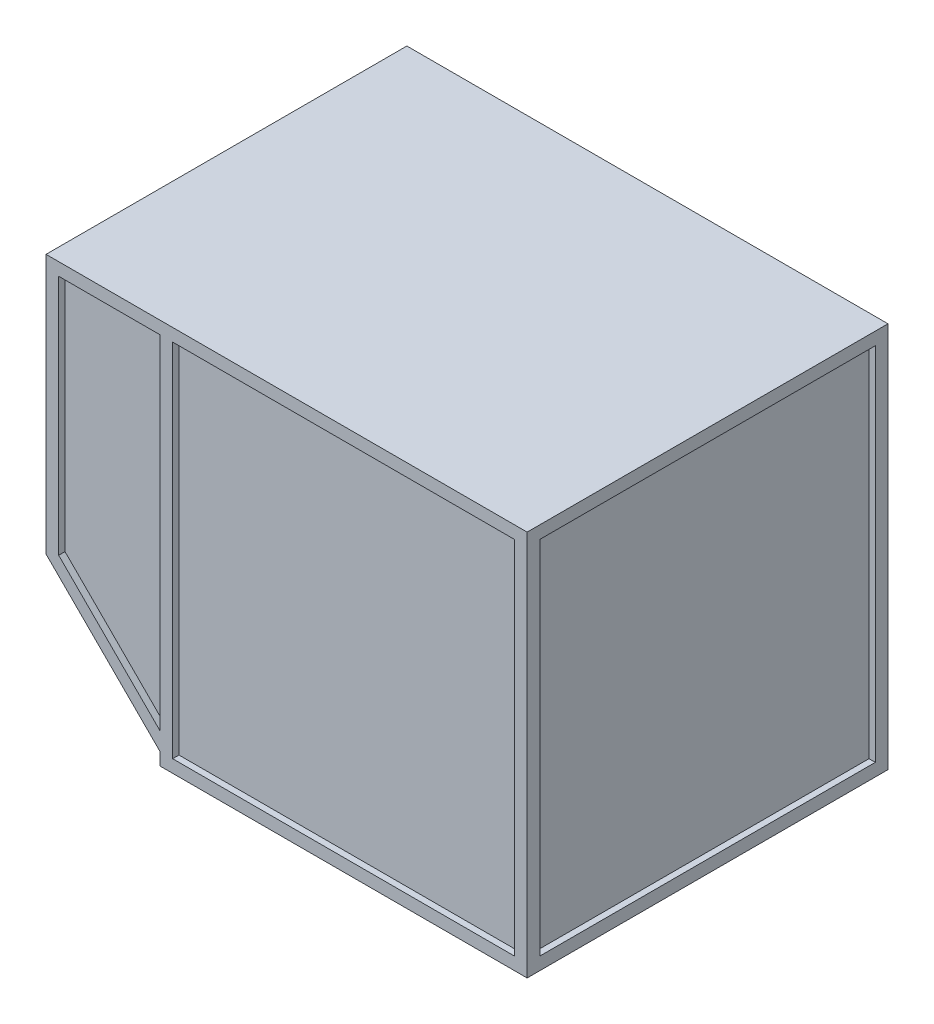
ISO-10303-21;
HEADER;
FILE_DESCRIPTION(('STEP AP214'),'2;1');
FILE_NAME('part.step','',(''),(''),'','','');
FILE_SCHEMA(('AUTOMOTIVE_DESIGN { 1 0 10303 214 1 1 1 1 }'));
ENDSEC;
DATA;
#1=APPLICATION_CONTEXT('core data for automotive mechanical design processes');
#2=APPLICATION_PROTOCOL_DEFINITION('international standard','automotive_design',2000,#1);
#3=PRODUCT_CONTEXT('',#1,'mechanical');
#4=PRODUCT('Part','Part','',(#3));
#5=PRODUCT_RELATED_PRODUCT_CATEGORY('part','',(#4));
#6=PRODUCT_DEFINITION_FORMATION('','',#4);
#7=PRODUCT_DEFINITION_CONTEXT('part definition',#1,'design');
#8=PRODUCT_DEFINITION('design','',#6,#7);
#9=PRODUCT_DEFINITION_SHAPE('','',#8);
#10=(LENGTH_UNIT() NAMED_UNIT(*) SI_UNIT(.MILLI.,.METRE.));
#11=(NAMED_UNIT(*) PLANE_ANGLE_UNIT() SI_UNIT($,.RADIAN.));
#12=(NAMED_UNIT(*) SI_UNIT($,.STERADIAN.) SOLID_ANGLE_UNIT());
#13=UNCERTAINTY_MEASURE_WITH_UNIT(LENGTH_MEASURE(1.E-05),#10,'distance_accuracy_value','');
#14=(GEOMETRIC_REPRESENTATION_CONTEXT(3) GLOBAL_UNCERTAINTY_ASSIGNED_CONTEXT((#13)) GLOBAL_UNIT_ASSIGNED_CONTEXT((#10,
#11,#12)) REPRESENTATION_CONTEXT('',''));
#15=CARTESIAN_POINT('',(0.,0.,0.));
#16=DIRECTION('',(0.,0.,1.));
#17=DIRECTION('',(1.,0.,0.));
#18=AXIS2_PLACEMENT_3D('',#15,#16,#17);
#19=CARTESIAN_POINT('',(-965.2,1549.4,-723.9));
#20=DIRECTION('',(0.,0.,1.));
#21=DIRECTION('',(1.,0.,0.));
#22=AXIS2_PLACEMENT_3D('',#19,#20,#21);
#23=PLANE('',#22);
#24=DIRECTION('',(0.,-1.,0.));
#25=VECTOR('',#24,1.);
#26=CARTESIAN_POINT('',(-914.4,1549.4,-723.9));
#27=LINE('',#26,#25);
#28=CARTESIAN_POINT('',(-914.4,1498.6,-723.9));
#29=VERTEX_POINT('',#28);
#30=CARTESIAN_POINT('',(-914.4,529.042048968553,-723.9));
#31=VERTEX_POINT('',#30);
#32=EDGE_CURVE('E328',#29,#31,#27,.T.);
#33=ORIENTED_EDGE('',*,*,#32,.T.);
#34=DIRECTION('',(0.707106781186548,-0.707106781186547,0.));
#35=VECTOR('',#34,1.);
#36=CARTESIAN_POINT('',(-1449.97897551572,1064.62102448428,-723.9));
#37=LINE('',#36,#35);
#38=CARTESIAN_POINT('',(-508.,122.642048968554,-723.9));
#39=VERTEX_POINT('',#38);
#40=EDGE_CURVE('E342',#31,#39,#37,.T.);
#41=ORIENTED_EDGE('',*,*,#40,.T.);
#42=DIRECTION('',(0.,1.,0.));
#43=VECTOR('',#42,1.);
#44=CARTESIAN_POINT('',(-508.,1549.4,-723.9));
#45=LINE('',#44,#43);
#46=CARTESIAN_POINT('',(-508.,1498.6,-723.9));
#47=VERTEX_POINT('',#46);
#48=EDGE_CURVE('E345',#39,#47,#45,.T.);
#49=ORIENTED_EDGE('',*,*,#48,.T.);
#50=DIRECTION('',(-1.,0.,0.));
#51=VECTOR('',#50,1.);
#52=CARTESIAN_POINT('',(-965.2,1498.6,-723.9));
#53=LINE('',#52,#51);
#54=EDGE_CURVE('E333',#47,#29,#53,.T.);
#55=ORIENTED_EDGE('',*,*,#54,.T.);
#56=EDGE_LOOP('',(#33,#41,#49,#55));
#57=FACE_BOUND('',#56,.T.);
#58=DIRECTION('',(0.,-1.,0.));
#59=VECTOR('',#58,1.);
#60=CARTESIAN_POINT('',(-508.,0.,-723.9));
#61=LINE('',#60,#59);
#62=CARTESIAN_POINT('',(-508.,50.8,-723.9));
#63=VERTEX_POINT('',#62);
#64=CARTESIAN_POINT('',(-508.,0.,-723.9));
#65=VERTEX_POINT('',#64);
#66=EDGE_CURVE('E423',#63,#65,#61,.T.);
#67=ORIENTED_EDGE('',*,*,#66,.F.);
#68=DIRECTION('',(0.707106781186547,-0.707106781186548,0.));
#69=VECTOR('',#68,1.);
#70=CARTESIAN_POINT('',(-508.,50.8,-723.9));
#71=LINE('',#70,#69);
#72=CARTESIAN_POINT('',(-965.2,508.,-723.9));
#73=VERTEX_POINT('',#72);
#74=EDGE_CURVE('E425',#73,#63,#71,.T.);
#75=ORIENTED_EDGE('',*,*,#74,.F.);
#76=DIRECTION('',(0.,-1.,0.));
#77=VECTOR('',#76,1.);
#78=CARTESIAN_POINT('',(-965.2,1549.4,-723.9));
#79=LINE('',#78,#77);
#80=CARTESIAN_POINT('',(-965.2,1549.4,-723.9));
#81=VERTEX_POINT('',#80);
#82=EDGE_CURVE('E449',#81,#73,#79,.T.);
#83=ORIENTED_EDGE('',*,*,#82,.F.);
#84=DIRECTION('',(-1.,0.,0.));
#85=VECTOR('',#84,1.);
#86=CARTESIAN_POINT('',(-965.2,1549.4,-723.9));
#87=LINE('',#86,#85);
#88=CARTESIAN_POINT('',(965.2,1549.4,-723.9));
#89=VERTEX_POINT('',#88);
#90=EDGE_CURVE('E447',#89,#81,#87,.T.);
#91=ORIENTED_EDGE('',*,*,#90,.F.);
#92=DIRECTION('',(0.,-1.,0.));
#93=VECTOR('',#92,1.);
#94=CARTESIAN_POINT('',(965.2,1549.4,-723.9));
#95=LINE('',#94,#93);
#96=CARTESIAN_POINT('',(965.2,0.,-723.9));
#97=VERTEX_POINT('',#96);
#98=EDGE_CURVE('E457',#89,#97,#95,.T.);
#99=ORIENTED_EDGE('',*,*,#98,.T.);
#100=DIRECTION('',(-1.,0.,0.));
#101=VECTOR('',#100,1.);
#102=CARTESIAN_POINT('',(-965.2,0.,-723.9));
#103=LINE('',#102,#101);
#104=EDGE_CURVE('E443',#97,#65,#103,.T.);
#105=ORIENTED_EDGE('',*,*,#104,.T.);
#106=EDGE_LOOP('',(#67,#75,#83,#91,#99,#105));
#107=FACE_BOUND('',#106,.T.);
#108=DIRECTION('',(1.,0.,0.));
#109=VECTOR('',#108,1.);
#110=CARTESIAN_POINT('',(-965.2,50.8,-723.9));
#111=LINE('',#110,#109);
#112=CARTESIAN_POINT('',(-457.2,50.8,-723.9));
#113=VERTEX_POINT('',#112);
#114=CARTESIAN_POINT('',(914.4,50.8,-723.9));
#115=VERTEX_POINT('',#114);
#116=EDGE_CURVE('E291',#113,#115,#111,.T.);
#117=ORIENTED_EDGE('',*,*,#116,.T.);
#118=DIRECTION('',(0.,1.,0.));
#119=VECTOR('',#118,1.);
#120=CARTESIAN_POINT('',(914.4,1549.4,-723.9));
#121=LINE('',#120,#119);
#122=CARTESIAN_POINT('',(914.4,1498.6,-723.9));
#123=VERTEX_POINT('',#122);
#124=EDGE_CURVE('E310',#115,#123,#121,.T.);
#125=ORIENTED_EDGE('',*,*,#124,.T.);
#126=DIRECTION('',(-1.,0.,0.));
#127=VECTOR('',#126,1.);
#128=CARTESIAN_POINT('',(-965.2,1498.6,-723.9));
#129=LINE('',#128,#127);
#130=CARTESIAN_POINT('',(-457.2,1498.6,-723.9));
#131=VERTEX_POINT('',#130);
#132=EDGE_CURVE('E313',#123,#131,#129,.T.);
#133=ORIENTED_EDGE('',*,*,#132,.T.);
#134=DIRECTION('',(0.,-1.,0.));
#135=VECTOR('',#134,1.);
#136=CARTESIAN_POINT('',(-457.2,1549.4,-723.9));
#137=LINE('',#136,#135);
#138=EDGE_CURVE('E301',#131,#113,#137,.T.);
#139=ORIENTED_EDGE('',*,*,#138,.T.);
#140=EDGE_LOOP('',(#117,#125,#133,#139));
#141=FACE_BOUND('',#140,.T.);
#142=ADVANCED_FACE('F31',(#57,#107,#141),#23,.F.);
#143=CARTESIAN_POINT('',(-965.2,1549.4,-723.9));
#144=DIRECTION('',(1.,0.,0.));
#145=DIRECTION('',(0.,0.,-1.));
#146=AXIS2_PLACEMENT_3D('',#143,#144,#145);
#147=PLANE('',#146);
#148=DIRECTION('',(0.,0.,1.));
#149=VECTOR('',#148,1.);
#150=CARTESIAN_POINT('',(-965.2,558.8,-673.1));
#151=LINE('',#150,#149);
#152=CARTESIAN_POINT('',(-965.2,558.8,-673.1));
#153=VERTEX_POINT('',#152);
#154=CARTESIAN_POINT('',(-965.2,558.8,673.1));
#155=VERTEX_POINT('',#154);
#156=EDGE_CURVE('E281',#153,#155,#151,.T.);
#157=ORIENTED_EDGE('',*,*,#156,.F.);
#158=DIRECTION('',(0.,-1.,0.));
#159=VECTOR('',#158,1.);
#160=CARTESIAN_POINT('',(-965.2,1498.6,-673.1));
#161=LINE('',#160,#159);
#162=CARTESIAN_POINT('',(-965.2,1498.6,-673.1));
#163=VERTEX_POINT('',#162);
#164=EDGE_CURVE('E54',#163,#153,#161,.T.);
#165=ORIENTED_EDGE('',*,*,#164,.F.);
#166=DIRECTION('',(0.,0.,-1.));
#167=VECTOR('',#166,1.);
#168=CARTESIAN_POINT('',(-965.2,1498.6,-673.1));
#169=LINE('',#168,#167);
#170=CARTESIAN_POINT('',(-965.2,1498.6,673.1));
#171=VERTEX_POINT('',#170);
#172=EDGE_CURVE('E270',#171,#163,#169,.T.);
#173=ORIENTED_EDGE('',*,*,#172,.F.);
#174=DIRECTION('',(0.,1.,0.));
#175=VECTOR('',#174,1.);
#176=CARTESIAN_POINT('',(-965.2,1498.6,673.1));
#177=LINE('',#176,#175);
#178=EDGE_CURVE('E284',#155,#171,#177,.T.);
#179=ORIENTED_EDGE('',*,*,#178,.F.);
#180=EDGE_LOOP('',(#157,#165,#173,#179));
#181=FACE_BOUND('',#180,.T.);
#182=ORIENTED_EDGE('',*,*,#82,.T.);
#183=DIRECTION('',(0.,0.,1.));
#184=VECTOR('',#183,1.);
#185=CARTESIAN_POINT('',(-965.2,508.,-1407.34410159134));
#186=LINE('',#185,#184);
#187=CARTESIAN_POINT('',(-965.2,508.,723.9));
#188=VERTEX_POINT('',#187);
#189=EDGE_CURVE('E426',#73,#188,#186,.T.);
#190=ORIENTED_EDGE('',*,*,#189,.T.);
#191=DIRECTION('',(0.,-1.,0.));
#192=VECTOR('',#191,1.);
#193=CARTESIAN_POINT('',(-965.2,1549.4,723.9));
#194=LINE('',#193,#192);
#195=CARTESIAN_POINT('',(-965.2,1549.4,723.9));
#196=VERTEX_POINT('',#195);
#197=EDGE_CURVE('E11',#196,#188,#194,.T.);
#198=ORIENTED_EDGE('',*,*,#197,.F.);
#199=DIRECTION('',(0.,0.,1.));
#200=VECTOR('',#199,1.);
#201=CARTESIAN_POINT('',(-965.2,1549.4,-723.9));
#202=LINE('',#201,#200);
#203=EDGE_CURVE('E439',#81,#196,#202,.T.);
#204=ORIENTED_EDGE('',*,*,#203,.F.);
#205=EDGE_LOOP('',(#182,#190,#198,#204));
#206=FACE_BOUND('',#205,.T.);
#207=ADVANCED_FACE('F33',(#181,#206),#147,.F.);
#208=CARTESIAN_POINT('',(-965.2,1549.4,723.9));
#209=DIRECTION('',(0.,0.,-1.));
#210=DIRECTION('',(-1.,0.,0.));
#211=AXIS2_PLACEMENT_3D('',#208,#209,#210);
#212=PLANE('',#211);
#213=DIRECTION('',(0.,-1.,0.));
#214=VECTOR('',#213,1.);
#215=CARTESIAN_POINT('',(-457.2,71.8420489685534,723.9));
#216=LINE('',#215,#214);
#217=CARTESIAN_POINT('',(-457.2,1498.6,723.9));
#218=VERTEX_POINT('',#217);
#219=CARTESIAN_POINT('',(-457.2,50.8,723.9));
#220=VERTEX_POINT('',#219);
#221=EDGE_CURVE('E359',#218,#220,#216,.T.);
#222=ORIENTED_EDGE('',*,*,#221,.F.);
#223=DIRECTION('',(-1.,0.,0.));
#224=VECTOR('',#223,1.);
#225=CARTESIAN_POINT('',(914.4,1498.6,723.9));
#226=LINE('',#225,#224);
#227=CARTESIAN_POINT('',(914.4,1498.6,723.9));
#228=VERTEX_POINT('',#227);
#229=EDGE_CURVE('E363',#228,#218,#226,.T.);
#230=ORIENTED_EDGE('',*,*,#229,.F.);
#231=DIRECTION('',(0.,1.,0.));
#232=VECTOR('',#231,1.);
#233=CARTESIAN_POINT('',(914.4,50.8,723.9));
#234=LINE('',#233,#232);
#235=CARTESIAN_POINT('',(914.4,50.8,723.9));
#236=VERTEX_POINT('',#235);
#237=EDGE_CURVE('E378',#236,#228,#234,.T.);
#238=ORIENTED_EDGE('',*,*,#237,.F.);
#239=DIRECTION('',(1.,0.,0.));
#240=VECTOR('',#239,1.);
#241=CARTESIAN_POINT('',(-457.2,50.8,723.9));
#242=LINE('',#241,#240);
#243=EDGE_CURVE('E375',#220,#236,#242,.T.);
#244=ORIENTED_EDGE('',*,*,#243,.F.);
#245=EDGE_LOOP('',(#222,#230,#238,#244));
#246=FACE_BOUND('',#245,.T.);
#247=DIRECTION('',(0.,-1.,0.));
#248=VECTOR('',#247,1.);
#249=CARTESIAN_POINT('',(-914.4,1498.6,723.9));
#250=LINE('',#249,#248);
#251=CARTESIAN_POINT('',(-914.4,1498.6,723.9));
#252=VERTEX_POINT('',#251);
#253=CARTESIAN_POINT('',(-914.4,529.042048968553,723.9));
#254=VERTEX_POINT('',#253);
#255=EDGE_CURVE('E406',#252,#254,#250,.T.);
#256=ORIENTED_EDGE('',*,*,#255,.F.);
#257=DIRECTION('',(-1.,0.,0.));
#258=VECTOR('',#257,1.);
#259=CARTESIAN_POINT('',(-508.,1498.6,723.9));
#260=LINE('',#259,#258);
#261=CARTESIAN_POINT('',(-508.,1498.6,723.9));
#262=VERTEX_POINT('',#261);
#263=EDGE_CURVE('E385',#262,#252,#260,.T.);
#264=ORIENTED_EDGE('',*,*,#263,.F.);
#265=DIRECTION('',(0.,1.,0.));
#266=VECTOR('',#265,1.);
#267=CARTESIAN_POINT('',(-508.,1498.6,723.9));
#268=LINE('',#267,#266);
#269=CARTESIAN_POINT('',(-508.,122.642048968554,723.9));
#270=VERTEX_POINT('',#269);
#271=EDGE_CURVE('E395',#270,#262,#268,.T.);
#272=ORIENTED_EDGE('',*,*,#271,.F.);
#273=DIRECTION('',(0.707106781186548,-0.707106781186547,0.));
#274=VECTOR('',#273,1.);
#275=CARTESIAN_POINT('',(-914.4,529.042048968553,723.9));
#276=LINE('',#275,#274);
#277=EDGE_CURVE('E409',#254,#270,#276,.T.);
#278=ORIENTED_EDGE('',*,*,#277,.F.);
#279=EDGE_LOOP('',(#256,#264,#272,#278));
#280=FACE_BOUND('',#279,.T.);
#281=ORIENTED_EDGE('',*,*,#197,.T.);
#282=DIRECTION('',(-0.707106781186547,0.707106781186548,0.));
#283=VECTOR('',#282,1.);
#284=CARTESIAN_POINT('',(-508.,50.8,723.9));
#285=LINE('',#284,#283);
#286=CARTESIAN_POINT('',(-508.,50.8,723.9));
#287=VERTEX_POINT('',#286);
#288=EDGE_CURVE('E431',#287,#188,#285,.T.);
#289=ORIENTED_EDGE('',*,*,#288,.F.);
#290=DIRECTION('',(0.,1.,0.));
#291=VECTOR('',#290,1.);
#292=CARTESIAN_POINT('',(-508.,0.,723.9));
#293=LINE('',#292,#291);
#294=CARTESIAN_POINT('',(-508.,0.,723.9));
#295=VERTEX_POINT('',#294);
#296=EDGE_CURVE('E416',#295,#287,#293,.T.);
#297=ORIENTED_EDGE('',*,*,#296,.F.);
#298=DIRECTION('',(1.,0.,0.));
#299=VECTOR('',#298,1.);
#300=CARTESIAN_POINT('',(-965.2,0.,723.9));
#301=LINE('',#300,#299);
#302=CARTESIAN_POINT('',(965.2,0.,723.9));
#303=VERTEX_POINT('',#302);
#304=EDGE_CURVE('E428',#295,#303,#301,.T.);
#305=ORIENTED_EDGE('',*,*,#304,.T.);
#306=DIRECTION('',(0.,-1.,0.));
#307=VECTOR('',#306,1.);
#308=CARTESIAN_POINT('',(965.2,1549.4,723.9));
#309=LINE('',#308,#307);
#310=CARTESIAN_POINT('',(965.2,1549.4,723.9));
#311=VERTEX_POINT('',#310);
#312=EDGE_CURVE('E39',#311,#303,#309,.T.);
#313=ORIENTED_EDGE('',*,*,#312,.F.);
#314=DIRECTION('',(1.,0.,0.));
#315=VECTOR('',#314,1.);
#316=CARTESIAN_POINT('',(-965.2,1549.4,723.9));
#317=LINE('',#316,#315);
#318=EDGE_CURVE('E442',#196,#311,#317,.T.);
#319=ORIENTED_EDGE('',*,*,#318,.F.);
#320=EDGE_LOOP('',(#281,#289,#297,#305,#313,#319));
#321=FACE_BOUND('',#320,.T.);
#322=ADVANCED_FACE('F482',(#246,#280,#321),#212,.F.);
#323=CARTESIAN_POINT('',(965.2,1549.4,-723.9));
#324=DIRECTION('',(-1.,0.,0.));
#325=DIRECTION('',(0.,0.,1.));
#326=AXIS2_PLACEMENT_3D('',#323,#324,#325);
#327=PLANE('',#326);
#328=DIRECTION('',(0.,0.,-1.));
#329=VECTOR('',#328,1.);
#330=CARTESIAN_POINT('',(965.2,50.8,673.1));
#331=LINE('',#330,#329);
#332=CARTESIAN_POINT('',(965.2,50.8,673.1));
#333=VERTEX_POINT('',#332);
#334=CARTESIAN_POINT('',(965.2,50.8,-673.1));
#335=VERTEX_POINT('',#334);
#336=EDGE_CURVE('E257',#333,#335,#331,.T.);
#337=ORIENTED_EDGE('',*,*,#336,.F.);
#338=DIRECTION('',(0.,-1.,0.));
#339=VECTOR('',#338,1.);
#340=CARTESIAN_POINT('',(965.2,1498.6,673.1));
#341=LINE('',#340,#339);
#342=CARTESIAN_POINT('',(965.2,1498.6,673.1));
#343=VERTEX_POINT('',#342);
#344=EDGE_CURVE('E46',#343,#333,#341,.T.);
#345=ORIENTED_EDGE('',*,*,#344,.F.);
#346=DIRECTION('',(0.,0.,1.));
#347=VECTOR('',#346,1.);
#348=CARTESIAN_POINT('',(965.2,1498.6,-673.1));
#349=LINE('',#348,#347);
#350=CARTESIAN_POINT('',(965.2,1498.6,-673.1));
#351=VERTEX_POINT('',#350);
#352=EDGE_CURVE('E248',#351,#343,#349,.T.);
#353=ORIENTED_EDGE('',*,*,#352,.F.);
#354=DIRECTION('',(0.,1.,0.));
#355=VECTOR('',#354,1.);
#356=CARTESIAN_POINT('',(965.2,50.8,-673.1));
#357=LINE('',#356,#355);
#358=EDGE_CURVE('E251',#335,#351,#357,.T.);
#359=ORIENTED_EDGE('',*,*,#358,.F.);
#360=EDGE_LOOP('',(#337,#345,#353,#359));
#361=FACE_BOUND('',#360,.T.);
#362=DIRECTION('',(0.,0.,-1.));
#363=VECTOR('',#362,1.);
#364=CARTESIAN_POINT('',(965.2,0.,-723.9));
#365=LINE('',#364,#363);
#366=EDGE_CURVE('E451',#303,#97,#365,.T.);
#367=ORIENTED_EDGE('',*,*,#366,.T.);
#368=ORIENTED_EDGE('',*,*,#98,.F.);
#369=DIRECTION('',(0.,0.,-1.));
#370=VECTOR('',#369,1.);
#371=CARTESIAN_POINT('',(965.2,1549.4,-723.9));
#372=LINE('',#371,#370);
#373=EDGE_CURVE('E445',#311,#89,#372,.T.);
#374=ORIENTED_EDGE('',*,*,#373,.F.);
#375=ORIENTED_EDGE('',*,*,#312,.T.);
#376=EDGE_LOOP('',(#367,#368,#374,#375));
#377=FACE_BOUND('',#376,.T.);
#378=ADVANCED_FACE('F464',(#361,#377),#327,.F.);
#379=CARTESIAN_POINT('',(-965.2,1549.4,723.9));
#380=DIRECTION('',(0.,1.,0.));
#381=DIRECTION('',(0.,0.,1.));
#382=AXIS2_PLACEMENT_3D('',#379,#380,#381);
#383=PLANE('',#382);
#384=ORIENTED_EDGE('',*,*,#203,.T.);
#385=ORIENTED_EDGE('',*,*,#318,.T.);
#386=ORIENTED_EDGE('',*,*,#373,.T.);
#387=ORIENTED_EDGE('',*,*,#90,.T.);
#388=EDGE_LOOP('',(#384,#385,#386,#387));
#389=FACE_BOUND('',#388,.T.);
#390=ADVANCED_FACE('F480',(#389),#383,.T.);
#391=CARTESIAN_POINT('',(-965.2,0.,723.9));
#392=DIRECTION('',(0.,1.,0.));
#393=DIRECTION('',(0.,0.,1.));
#394=AXIS2_PLACEMENT_3D('',#391,#392,#393);
#395=PLANE('',#394);
#396=ORIENTED_EDGE('',*,*,#304,.F.);
#397=DIRECTION('',(0.,0.,1.));
#398=VECTOR('',#397,1.);
#399=CARTESIAN_POINT('',(-508.,0.,-1407.34410159134));
#400=LINE('',#399,#398);
#401=EDGE_CURVE('E433',#65,#295,#400,.T.);
#402=ORIENTED_EDGE('',*,*,#401,.F.);
#403=ORIENTED_EDGE('',*,*,#104,.F.);
#404=ORIENTED_EDGE('',*,*,#366,.F.);
#405=EDGE_LOOP('',(#396,#402,#403,#404));
#406=FACE_BOUND('',#405,.T.);
#407=ADVANCED_FACE('F470',(#406),#395,.F.);
#408=CARTESIAN_POINT('',(-508.,50.8,-1407.34410159134));
#409=DIRECTION('',(0.707106781186548,0.707106781186547,0.));
#410=DIRECTION('',(-0.707106781186547,0.707106781186548,0.));
#411=AXIS2_PLACEMENT_3D('',#408,#409,#410);
#412=PLANE('',#411);
#413=ORIENTED_EDGE('',*,*,#74,.T.);
#414=DIRECTION('',(0.,0.,1.));
#415=VECTOR('',#414,1.);
#416=CARTESIAN_POINT('',(-508.,50.8,-1407.34410159134));
#417=LINE('',#416,#415);
#418=EDGE_CURVE('E436',#63,#287,#417,.T.);
#419=ORIENTED_EDGE('',*,*,#418,.T.);
#420=ORIENTED_EDGE('',*,*,#288,.T.);
#421=ORIENTED_EDGE('',*,*,#189,.F.);
#422=EDGE_LOOP('',(#413,#419,#420,#421));
#423=FACE_BOUND('',#422,.T.);
#424=ADVANCED_FACE('F487',(#423),#412,.F.);
#425=CARTESIAN_POINT('',(-508.,0.,-1407.34410159134));
#426=DIRECTION('',(1.,0.,0.));
#427=DIRECTION('',(0.,0.,-1.));
#428=AXIS2_PLACEMENT_3D('',#425,#426,#427);
#429=PLANE('',#428);
#430=ORIENTED_EDGE('',*,*,#66,.T.);
#431=ORIENTED_EDGE('',*,*,#401,.T.);
#432=ORIENTED_EDGE('',*,*,#296,.T.);
#433=ORIENTED_EDGE('',*,*,#418,.F.);
#434=EDGE_LOOP('',(#430,#431,#432,#433));
#435=FACE_BOUND('',#434,.T.);
#436=ADVANCED_FACE('F490',(#435),#429,.F.);
#437=CARTESIAN_POINT('',(-508.,1498.6,698.5));
#438=DIRECTION('',(0.,1.,0.));
#439=DIRECTION('',(0.,0.,1.));
#440=AXIS2_PLACEMENT_3D('',#437,#438,#439);
#441=PLANE('',#440);
#442=ORIENTED_EDGE('',*,*,#263,.T.);
#443=DIRECTION('',(0.,0.,1.));
#444=VECTOR('',#443,1.);
#445=CARTESIAN_POINT('',(-914.4,1498.6,698.5));
#446=LINE('',#445,#444);
#447=CARTESIAN_POINT('',(-914.4,1498.6,698.5));
#448=VERTEX_POINT('',#447);
#449=EDGE_CURVE('E404',#448,#252,#446,.T.);
#450=ORIENTED_EDGE('',*,*,#449,.F.);
#451=DIRECTION('',(-1.,0.,0.));
#452=VECTOR('',#451,1.);
#453=CARTESIAN_POINT('',(-508.,1498.6,698.5));
#454=LINE('',#453,#452);
#455=CARTESIAN_POINT('',(-508.,1498.6,698.5));
#456=VERTEX_POINT('',#455);
#457=EDGE_CURVE('E391',#456,#448,#454,.T.);
#458=ORIENTED_EDGE('',*,*,#457,.F.);
#459=DIRECTION('',(0.,0.,1.));
#460=VECTOR('',#459,1.);
#461=CARTESIAN_POINT('',(-508.,1498.6,698.5));
#462=LINE('',#461,#460);
#463=EDGE_CURVE('E414',#456,#262,#462,.T.);
#464=ORIENTED_EDGE('',*,*,#463,.T.);
#465=EDGE_LOOP('',(#442,#450,#458,#464));
#466=FACE_BOUND('',#465,.T.);
#467=ADVANCED_FACE('F492',(#466),#441,.F.);
#468=CARTESIAN_POINT('',(-508.,1498.6,698.5));
#469=DIRECTION('',(1.,0.,0.));
#470=DIRECTION('',(0.,0.,-1.));
#471=AXIS2_PLACEMENT_3D('',#468,#469,#470);
#472=PLANE('',#471);
#473=ORIENTED_EDGE('',*,*,#271,.T.);
#474=ORIENTED_EDGE('',*,*,#463,.F.);
#475=DIRECTION('',(0.,1.,0.));
#476=VECTOR('',#475,1.);
#477=CARTESIAN_POINT('',(-508.,1498.6,698.5));
#478=LINE('',#477,#476);
#479=CARTESIAN_POINT('',(-508.,122.642048968554,698.5));
#480=VERTEX_POINT('',#479);
#481=EDGE_CURVE('E401',#480,#456,#478,.T.);
#482=ORIENTED_EDGE('',*,*,#481,.F.);
#483=DIRECTION('',(0.,0.,1.));
#484=VECTOR('',#483,1.);
#485=CARTESIAN_POINT('',(-508.,122.642048968554,698.5));
#486=LINE('',#485,#484);
#487=EDGE_CURVE('E417',#480,#270,#486,.T.);
#488=ORIENTED_EDGE('',*,*,#487,.T.);
#489=EDGE_LOOP('',(#473,#474,#482,#488));
#490=FACE_BOUND('',#489,.T.);
#491=ADVANCED_FACE('F498',(#490),#472,.F.);
#492=CARTESIAN_POINT('',(-914.4,529.042048968553,698.5));
#493=DIRECTION('',(-0.707106781186547,-0.707106781186548,0.));
#494=DIRECTION('',(0.707106781186548,-0.707106781186547,0.));
#495=AXIS2_PLACEMENT_3D('',#492,#493,#494);
#496=PLANE('',#495);
#497=ORIENTED_EDGE('',*,*,#277,.T.);
#498=ORIENTED_EDGE('',*,*,#487,.F.);
#499=DIRECTION('',(0.707106781186548,-0.707106781186547,0.));
#500=VECTOR('',#499,1.);
#501=CARTESIAN_POINT('',(-914.4,529.042048968553,698.5));
#502=LINE('',#501,#500);
#503=CARTESIAN_POINT('',(-914.4,529.042048968553,698.5));
#504=VERTEX_POINT('',#503);
#505=EDGE_CURVE('E398',#504,#480,#502,.T.);
#506=ORIENTED_EDGE('',*,*,#505,.F.);
#507=DIRECTION('',(0.,0.,1.));
#508=VECTOR('',#507,1.);
#509=CARTESIAN_POINT('',(-914.4,529.042048968553,698.5));
#510=LINE('',#509,#508);
#511=EDGE_CURVE('E419',#504,#254,#510,.T.);
#512=ORIENTED_EDGE('',*,*,#511,.T.);
#513=EDGE_LOOP('',(#497,#498,#506,#512));
#514=FACE_BOUND('',#513,.T.);
#515=ADVANCED_FACE('F534',(#514),#496,.F.);
#516=CARTESIAN_POINT('',(-914.4,1498.6,698.5));
#517=DIRECTION('',(-1.,0.,0.));
#518=DIRECTION('',(0.,0.,1.));
#519=AXIS2_PLACEMENT_3D('',#516,#517,#518);
#520=PLANE('',#519);
#521=ORIENTED_EDGE('',*,*,#255,.T.);
#522=ORIENTED_EDGE('',*,*,#511,.F.);
#523=DIRECTION('',(0.,-1.,0.));
#524=VECTOR('',#523,1.);
#525=CARTESIAN_POINT('',(-914.4,1498.6,698.5));
#526=LINE('',#525,#524);
#527=EDGE_CURVE('E394',#448,#504,#526,.T.);
#528=ORIENTED_EDGE('',*,*,#527,.F.);
#529=ORIENTED_EDGE('',*,*,#449,.T.);
#530=EDGE_LOOP('',(#521,#522,#528,#529));
#531=FACE_BOUND('',#530,.T.);
#532=ADVANCED_FACE('F527',(#531),#520,.F.);
#533=CARTESIAN_POINT('',(-914.4,1498.6,698.5));
#534=DIRECTION('',(0.,0.,1.));
#535=DIRECTION('',(1.,0.,0.));
#536=AXIS2_PLACEMENT_3D('',#533,#534,#535);
#537=PLANE('',#536);
#538=ORIENTED_EDGE('',*,*,#457,.T.);
#539=ORIENTED_EDGE('',*,*,#527,.T.);
#540=ORIENTED_EDGE('',*,*,#505,.T.);
#541=ORIENTED_EDGE('',*,*,#481,.T.);
#542=EDGE_LOOP('',(#538,#539,#540,#541));
#543=FACE_BOUND('',#542,.T.);
#544=ADVANCED_FACE('F536',(#543),#537,.T.);
#545=CARTESIAN_POINT('',(914.4,1498.6,698.5));
#546=DIRECTION('',(0.,1.,0.));
#547=DIRECTION('',(0.,0.,1.));
#548=AXIS2_PLACEMENT_3D('',#545,#546,#547);
#549=PLANE('',#548);
#550=ORIENTED_EDGE('',*,*,#229,.T.);
#551=DIRECTION('',(0.,0.,1.));
#552=VECTOR('',#551,1.);
#553=CARTESIAN_POINT('',(-457.2,1498.6,698.5));
#554=LINE('',#553,#552);
#555=CARTESIAN_POINT('',(-457.2,1498.6,698.5));
#556=VERTEX_POINT('',#555);
#557=EDGE_CURVE('E382',#556,#218,#554,.T.);
#558=ORIENTED_EDGE('',*,*,#557,.F.);
#559=DIRECTION('',(-1.,0.,0.));
#560=VECTOR('',#559,1.);
#561=CARTESIAN_POINT('',(914.4,1498.6,698.5));
#562=LINE('',#561,#560);
#563=CARTESIAN_POINT('',(914.4,1498.6,698.5));
#564=VERTEX_POINT('',#563);
#565=EDGE_CURVE('E369',#564,#556,#562,.T.);
#566=ORIENTED_EDGE('',*,*,#565,.F.);
#567=DIRECTION('',(0.,0.,1.));
#568=VECTOR('',#567,1.);
#569=CARTESIAN_POINT('',(914.4,1498.6,698.5));
#570=LINE('',#569,#568);
#571=EDGE_CURVE('E386',#564,#228,#570,.T.);
#572=ORIENTED_EDGE('',*,*,#571,.T.);
#573=EDGE_LOOP('',(#550,#558,#566,#572));
#574=FACE_BOUND('',#573,.T.);
#575=ADVANCED_FACE('F538',(#574),#549,.F.);
#576=CARTESIAN_POINT('',(914.4,50.8,698.5));
#577=DIRECTION('',(1.,0.,0.));
#578=DIRECTION('',(0.,0.,-1.));
#579=AXIS2_PLACEMENT_3D('',#576,#577,#578);
#580=PLANE('',#579);
#581=ORIENTED_EDGE('',*,*,#237,.T.);
#582=ORIENTED_EDGE('',*,*,#571,.F.);
#583=DIRECTION('',(0.,1.,0.));
#584=VECTOR('',#583,1.);
#585=CARTESIAN_POINT('',(914.4,50.8,698.5));
#586=LINE('',#585,#584);
#587=CARTESIAN_POINT('',(914.4,50.8,698.5));
#588=VERTEX_POINT('',#587);
#589=EDGE_CURVE('E366',#588,#564,#586,.T.);
#590=ORIENTED_EDGE('',*,*,#589,.F.);
#591=DIRECTION('',(0.,0.,1.));
#592=VECTOR('',#591,1.);
#593=CARTESIAN_POINT('',(914.4,50.8,698.5));
#594=LINE('',#593,#592);
#595=EDGE_CURVE('E388',#588,#236,#594,.T.);
#596=ORIENTED_EDGE('',*,*,#595,.T.);
#597=EDGE_LOOP('',(#581,#582,#590,#596));
#598=FACE_BOUND('',#597,.T.);
#599=ADVANCED_FACE('F544',(#598),#580,.F.);
#600=CARTESIAN_POINT('',(-457.2,50.8,698.5));
#601=DIRECTION('',(0.,-1.,0.));
#602=DIRECTION('',(0.,0.,-1.));
#603=AXIS2_PLACEMENT_3D('',#600,#601,#602);
#604=PLANE('',#603);
#605=ORIENTED_EDGE('',*,*,#243,.T.);
#606=ORIENTED_EDGE('',*,*,#595,.F.);
#607=DIRECTION('',(1.,0.,0.));
#608=VECTOR('',#607,1.);
#609=CARTESIAN_POINT('',(-457.2,50.8,698.5));
#610=LINE('',#609,#608);
#611=CARTESIAN_POINT('',(-457.2,50.8,698.5));
#612=VERTEX_POINT('',#611);
#613=EDGE_CURVE('E362',#612,#588,#610,.T.);
#614=ORIENTED_EDGE('',*,*,#613,.F.);
#615=DIRECTION('',(0.,0.,1.));
#616=VECTOR('',#615,1.);
#617=CARTESIAN_POINT('',(-457.2,50.8,698.5));
#618=LINE('',#617,#616);
#619=EDGE_CURVE('E372',#612,#220,#618,.T.);
#620=ORIENTED_EDGE('',*,*,#619,.T.);
#621=EDGE_LOOP('',(#605,#606,#614,#620));
#622=FACE_BOUND('',#621,.T.);
#623=ADVANCED_FACE('F582',(#622),#604,.F.);
#624=CARTESIAN_POINT('',(-457.2,71.8420489685534,698.5));
#625=DIRECTION('',(-1.,0.,0.));
#626=DIRECTION('',(0.,0.,1.));
#627=AXIS2_PLACEMENT_3D('',#624,#625,#626);
#628=PLANE('',#627);
#629=ORIENTED_EDGE('',*,*,#221,.T.);
#630=ORIENTED_EDGE('',*,*,#619,.F.);
#631=DIRECTION('',(0.,-1.,0.));
#632=VECTOR('',#631,1.);
#633=CARTESIAN_POINT('',(-457.2,71.8420489685534,698.5));
#634=LINE('',#633,#632);
#635=EDGE_CURVE('E360',#556,#612,#634,.T.);
#636=ORIENTED_EDGE('',*,*,#635,.F.);
#637=ORIENTED_EDGE('',*,*,#557,.T.);
#638=EDGE_LOOP('',(#629,#630,#636,#637));
#639=FACE_BOUND('',#638,.T.);
#640=ADVANCED_FACE('F550',(#639),#628,.F.);
#641=CARTESIAN_POINT('',(-457.2,1498.6,698.5));
#642=DIRECTION('',(0.,0.,1.));
#643=DIRECTION('',(1.,0.,0.));
#644=AXIS2_PLACEMENT_3D('',#641,#642,#643);
#645=PLANE('',#644);
#646=ORIENTED_EDGE('',*,*,#635,.T.);
#647=ORIENTED_EDGE('',*,*,#613,.T.);
#648=ORIENTED_EDGE('',*,*,#589,.T.);
#649=ORIENTED_EDGE('',*,*,#565,.T.);
#650=EDGE_LOOP('',(#646,#647,#648,#649));
#651=FACE_BOUND('',#650,.T.);
#652=ADVANCED_FACE('F601',(#651),#645,.T.);
#653=CARTESIAN_POINT('',(-914.4,1549.4,-698.5));
#654=DIRECTION('',(1.,0.,0.));
#655=DIRECTION('',(0.,0.,-1.));
#656=AXIS2_PLACEMENT_3D('',#653,#654,#655);
#657=PLANE('',#656);
#658=ORIENTED_EDGE('',*,*,#32,.F.);
#659=DIRECTION('',(0.,0.,-1.));
#660=VECTOR('',#659,1.);
#661=CARTESIAN_POINT('',(-914.4,1498.6,-698.5));
#662=LINE('',#661,#660);
#663=CARTESIAN_POINT('',(-914.4,1498.6,-698.5));
#664=VERTEX_POINT('',#663);
#665=EDGE_CURVE('E339',#664,#29,#662,.T.);
#666=ORIENTED_EDGE('',*,*,#665,.F.);
#667=DIRECTION('',(0.,-1.,0.));
#668=VECTOR('',#667,1.);
#669=CARTESIAN_POINT('',(-914.4,1549.4,-698.5));
#670=LINE('',#669,#668);
#671=CARTESIAN_POINT('',(-914.4,529.042048968553,-698.5));
#672=VERTEX_POINT('',#671);
#673=EDGE_CURVE('E329',#664,#672,#670,.T.);
#674=ORIENTED_EDGE('',*,*,#673,.T.);
#675=DIRECTION('',(0.,0.,-1.));
#676=VECTOR('',#675,1.);
#677=CARTESIAN_POINT('',(-914.4,529.042048968553,-698.5));
#678=LINE('',#677,#676);
#679=EDGE_CURVE('E356',#672,#31,#678,.T.);
#680=ORIENTED_EDGE('',*,*,#679,.T.);
#681=EDGE_LOOP('',(#658,#666,#674,#680));
#682=FACE_BOUND('',#681,.T.);
#683=ADVANCED_FACE('F609',(#682),#657,.T.);
#684=CARTESIAN_POINT('',(-1449.97897551572,1064.62102448428,-698.5));
#685=DIRECTION('',(0.707106781186547,0.707106781186548,0.));
#686=DIRECTION('',(-0.707106781186548,0.707106781186547,0.));
#687=AXIS2_PLACEMENT_3D('',#684,#685,#686);
#688=PLANE('',#687);
#689=ORIENTED_EDGE('',*,*,#40,.F.);
#690=ORIENTED_EDGE('',*,*,#679,.F.);
#691=DIRECTION('',(0.707106781186548,-0.707106781186547,0.));
#692=VECTOR('',#691,1.);
#693=CARTESIAN_POINT('',(-1449.97897551572,1064.62102448428,-698.5));
#694=LINE('',#693,#692);
#695=CARTESIAN_POINT('',(-508.,122.642048968554,-698.5));
#696=VERTEX_POINT('',#695);
#697=EDGE_CURVE('E332',#672,#696,#694,.T.);
#698=ORIENTED_EDGE('',*,*,#697,.T.);
#699=DIRECTION('',(0.,0.,-1.));
#700=VECTOR('',#699,1.);
#701=CARTESIAN_POINT('',(-508.,122.642048968554,-698.5));
#702=LINE('',#701,#700);
#703=EDGE_CURVE('E354',#696,#39,#702,.T.);
#704=ORIENTED_EDGE('',*,*,#703,.T.);
#705=EDGE_LOOP('',(#689,#690,#698,#704));
#706=FACE_BOUND('',#705,.T.);
#707=ADVANCED_FACE('F624',(#706),#688,.T.);
#708=CARTESIAN_POINT('',(-508.,1549.4,-698.5));
#709=DIRECTION('',(-1.,0.,0.));
#710=DIRECTION('',(0.,0.,1.));
#711=AXIS2_PLACEMENT_3D('',#708,#709,#710);
#712=PLANE('',#711);
#713=ORIENTED_EDGE('',*,*,#48,.F.);
#714=ORIENTED_EDGE('',*,*,#703,.F.);
#715=DIRECTION('',(0.,1.,0.));
#716=VECTOR('',#715,1.);
#717=CARTESIAN_POINT('',(-508.,1549.4,-698.5));
#718=LINE('',#717,#716);
#719=CARTESIAN_POINT('',(-508.,1498.6,-698.5));
#720=VERTEX_POINT('',#719);
#721=EDGE_CURVE('E335',#696,#720,#718,.T.);
#722=ORIENTED_EDGE('',*,*,#721,.T.);
#723=DIRECTION('',(0.,0.,-1.));
#724=VECTOR('',#723,1.);
#725=CARTESIAN_POINT('',(-508.,1498.6,-698.5));
#726=LINE('',#725,#724);
#727=EDGE_CURVE('E352',#720,#47,#726,.T.);
#728=ORIENTED_EDGE('',*,*,#727,.T.);
#729=EDGE_LOOP('',(#713,#714,#722,#728));
#730=FACE_BOUND('',#729,.T.);
#731=ADVANCED_FACE('F634',(#730),#712,.T.);
#732=CARTESIAN_POINT('',(-965.2,1498.6,-698.5));
#733=DIRECTION('',(0.,-1.,0.));
#734=DIRECTION('',(0.,0.,-1.));
#735=AXIS2_PLACEMENT_3D('',#732,#733,#734);
#736=PLANE('',#735);
#737=ORIENTED_EDGE('',*,*,#54,.F.);
#738=ORIENTED_EDGE('',*,*,#727,.F.);
#739=DIRECTION('',(-1.,0.,0.));
#740=VECTOR('',#739,1.);
#741=CARTESIAN_POINT('',(-965.2,1498.6,-698.5));
#742=LINE('',#741,#740);
#743=EDGE_CURVE('E337',#720,#664,#742,.T.);
#744=ORIENTED_EDGE('',*,*,#743,.T.);
#745=ORIENTED_EDGE('',*,*,#665,.T.);
#746=EDGE_LOOP('',(#737,#738,#744,#745));
#747=FACE_BOUND('',#746,.T.);
#748=ADVANCED_FACE('F644',(#747),#736,.T.);
#749=CARTESIAN_POINT('',(-914.4,1498.6,-698.5));
#750=DIRECTION('',(0.,0.,-1.));
#751=DIRECTION('',(-1.,0.,0.));
#752=AXIS2_PLACEMENT_3D('',#749,#750,#751);
#753=PLANE('',#752);
#754=ORIENTED_EDGE('',*,*,#673,.F.);
#755=ORIENTED_EDGE('',*,*,#743,.F.);
#756=ORIENTED_EDGE('',*,*,#721,.F.);
#757=ORIENTED_EDGE('',*,*,#697,.F.);
#758=EDGE_LOOP('',(#754,#755,#756,#757));
#759=FACE_BOUND('',#758,.T.);
#760=ADVANCED_FACE('F654',(#759),#753,.T.);
#761=CARTESIAN_POINT('',(-965.2,50.8,-698.5));
#762=DIRECTION('',(0.,1.,0.));
#763=DIRECTION('',(0.,0.,1.));
#764=AXIS2_PLACEMENT_3D('',#761,#762,#763);
#765=PLANE('',#764);
#766=ORIENTED_EDGE('',*,*,#116,.F.);
#767=DIRECTION('',(0.,0.,-1.));
#768=VECTOR('',#767,1.);
#769=CARTESIAN_POINT('',(-457.2,50.8,-698.5));
#770=LINE('',#769,#768);
#771=CARTESIAN_POINT('',(-457.2,50.8,-698.5));
#772=VERTEX_POINT('',#771);
#773=EDGE_CURVE('E307',#772,#113,#770,.T.);
#774=ORIENTED_EDGE('',*,*,#773,.F.);
#775=DIRECTION('',(1.,0.,0.));
#776=VECTOR('',#775,1.);
#777=CARTESIAN_POINT('',(-965.2,50.8,-698.5));
#778=LINE('',#777,#776);
#779=CARTESIAN_POINT('',(914.4,50.8,-698.5));
#780=VERTEX_POINT('',#779);
#781=EDGE_CURVE('E297',#772,#780,#778,.T.);
#782=ORIENTED_EDGE('',*,*,#781,.T.);
#783=DIRECTION('',(0.,0.,-1.));
#784=VECTOR('',#783,1.);
#785=CARTESIAN_POINT('',(914.4,50.8,-698.5));
#786=LINE('',#785,#784);
#787=EDGE_CURVE('E325',#780,#115,#786,.T.);
#788=ORIENTED_EDGE('',*,*,#787,.T.);
#789=EDGE_LOOP('',(#766,#774,#782,#788));
#790=FACE_BOUND('',#789,.T.);
#791=ADVANCED_FACE('F664',(#790),#765,.T.);
#792=CARTESIAN_POINT('',(914.4,1549.4,-698.5));
#793=DIRECTION('',(-1.,0.,0.));
#794=DIRECTION('',(0.,0.,1.));
#795=AXIS2_PLACEMENT_3D('',#792,#793,#794);
#796=PLANE('',#795);
#797=ORIENTED_EDGE('',*,*,#124,.F.);
#798=ORIENTED_EDGE('',*,*,#787,.F.);
#799=DIRECTION('',(0.,1.,0.));
#800=VECTOR('',#799,1.);
#801=CARTESIAN_POINT('',(914.4,1549.4,-698.5));
#802=LINE('',#801,#800);
#803=CARTESIAN_POINT('',(914.4,1498.6,-698.5));
#804=VERTEX_POINT('',#803);
#805=EDGE_CURVE('E300',#780,#804,#802,.T.);
#806=ORIENTED_EDGE('',*,*,#805,.T.);
#807=DIRECTION('',(0.,0.,-1.));
#808=VECTOR('',#807,1.);
#809=CARTESIAN_POINT('',(914.4,1498.6,-698.5));
#810=LINE('',#809,#808);
#811=EDGE_CURVE('E323',#804,#123,#810,.T.);
#812=ORIENTED_EDGE('',*,*,#811,.T.);
#813=EDGE_LOOP('',(#797,#798,#806,#812));
#814=FACE_BOUND('',#813,.T.);
#815=ADVANCED_FACE('F674',(#814),#796,.T.);
#816=CARTESIAN_POINT('',(-965.2,1498.6,-698.5));
#817=DIRECTION('',(0.,-1.,0.));
#818=DIRECTION('',(0.,0.,-1.));
#819=AXIS2_PLACEMENT_3D('',#816,#817,#818);
#820=PLANE('',#819);
#821=ORIENTED_EDGE('',*,*,#132,.F.);
#822=ORIENTED_EDGE('',*,*,#811,.F.);
#823=DIRECTION('',(-1.,0.,0.));
#824=VECTOR('',#823,1.);
#825=CARTESIAN_POINT('',(-965.2,1498.6,-698.5));
#826=LINE('',#825,#824);
#827=CARTESIAN_POINT('',(-457.2,1498.6,-698.5));
#828=VERTEX_POINT('',#827);
#829=EDGE_CURVE('E303',#804,#828,#826,.T.);
#830=ORIENTED_EDGE('',*,*,#829,.T.);
#831=DIRECTION('',(0.,0.,-1.));
#832=VECTOR('',#831,1.);
#833=CARTESIAN_POINT('',(-457.2,1498.6,-698.5));
#834=LINE('',#833,#832);
#835=EDGE_CURVE('E320',#828,#131,#834,.T.);
#836=ORIENTED_EDGE('',*,*,#835,.T.);
#837=EDGE_LOOP('',(#821,#822,#830,#836));
#838=FACE_BOUND('',#837,.T.);
#839=ADVANCED_FACE('F684',(#838),#820,.T.);
#840=CARTESIAN_POINT('',(-457.2,1549.4,-698.5));
#841=DIRECTION('',(1.,0.,0.));
#842=DIRECTION('',(0.,0.,-1.));
#843=AXIS2_PLACEMENT_3D('',#840,#841,#842);
#844=PLANE('',#843);
#845=ORIENTED_EDGE('',*,*,#138,.F.);
#846=ORIENTED_EDGE('',*,*,#835,.F.);
#847=DIRECTION('',(0.,-1.,0.));
#848=VECTOR('',#847,1.);
#849=CARTESIAN_POINT('',(-457.2,1549.4,-698.5));
#850=LINE('',#849,#848);
#851=EDGE_CURVE('E305',#828,#772,#850,.T.);
#852=ORIENTED_EDGE('',*,*,#851,.T.);
#853=ORIENTED_EDGE('',*,*,#773,.T.);
#854=EDGE_LOOP('',(#845,#846,#852,#853));
#855=FACE_BOUND('',#854,.T.);
#856=ADVANCED_FACE('F694',(#855),#844,.T.);
#857=CARTESIAN_POINT('',(914.4,50.8,-698.5));
#858=DIRECTION('',(0.,0.,1.));
#859=DIRECTION('',(1.,0.,0.));
#860=AXIS2_PLACEMENT_3D('',#857,#858,#859);
#861=PLANE('',#860);
#862=ORIENTED_EDGE('',*,*,#781,.F.);
#863=ORIENTED_EDGE('',*,*,#851,.F.);
#864=ORIENTED_EDGE('',*,*,#829,.F.);
#865=ORIENTED_EDGE('',*,*,#805,.F.);
#866=EDGE_LOOP('',(#862,#863,#864,#865));
#867=FACE_BOUND('',#866,.T.);
#868=ADVANCED_FACE('F705',(#867),#861,.F.);
#869=CARTESIAN_POINT('',(-939.8,1498.6,-673.1));
#870=DIRECTION('',(0.,0.,-1.));
#871=DIRECTION('',(-1.,0.,0.));
#872=AXIS2_PLACEMENT_3D('',#869,#870,#871);
#873=PLANE('',#872);
#874=ORIENTED_EDGE('',*,*,#164,.T.);
#875=DIRECTION('',(-1.,0.,0.));
#876=VECTOR('',#875,1.);
#877=CARTESIAN_POINT('',(-939.8,558.8,-673.1));
#878=LINE('',#877,#876);
#879=CARTESIAN_POINT('',(-939.8,558.8,-673.1));
#880=VERTEX_POINT('',#879);
#881=EDGE_CURVE('E279',#880,#153,#878,.T.);
#882=ORIENTED_EDGE('',*,*,#881,.F.);
#883=DIRECTION('',(0.,-1.,0.));
#884=VECTOR('',#883,1.);
#885=CARTESIAN_POINT('',(-939.8,1498.6,-673.1));
#886=LINE('',#885,#884);
#887=CARTESIAN_POINT('',(-939.8,1498.6,-673.1));
#888=VERTEX_POINT('',#887);
#889=EDGE_CURVE('E266',#888,#880,#886,.T.);
#890=ORIENTED_EDGE('',*,*,#889,.F.);
#891=DIRECTION('',(-1.,0.,0.));
#892=VECTOR('',#891,1.);
#893=CARTESIAN_POINT('',(-939.8,1498.6,-673.1));
#894=LINE('',#893,#892);
#895=EDGE_CURVE('E289',#888,#163,#894,.T.);
#896=ORIENTED_EDGE('',*,*,#895,.T.);
#897=EDGE_LOOP('',(#874,#882,#890,#896));
#898=FACE_BOUND('',#897,.T.);
#899=ADVANCED_FACE('F715',(#898),#873,.F.);
#900=CARTESIAN_POINT('',(-939.8,1498.6,-673.1));
#901=DIRECTION('',(0.,1.,0.));
#902=DIRECTION('',(0.,0.,1.));
#903=AXIS2_PLACEMENT_3D('',#900,#901,#902);
#904=PLANE('',#903);
#905=ORIENTED_EDGE('',*,*,#172,.T.);
#906=ORIENTED_EDGE('',*,*,#895,.F.);
#907=DIRECTION('',(0.,0.,-1.));
#908=VECTOR('',#907,1.);
#909=CARTESIAN_POINT('',(-939.8,1498.6,-673.1));
#910=LINE('',#909,#908);
#911=CARTESIAN_POINT('',(-939.8,1498.6,673.1));
#912=VERTEX_POINT('',#911);
#913=EDGE_CURVE('E276',#912,#888,#910,.T.);
#914=ORIENTED_EDGE('',*,*,#913,.F.);
#915=DIRECTION('',(-1.,0.,0.));
#916=VECTOR('',#915,1.);
#917=CARTESIAN_POINT('',(-939.8,1498.6,673.1));
#918=LINE('',#917,#916);
#919=EDGE_CURVE('E292',#912,#171,#918,.T.);
#920=ORIENTED_EDGE('',*,*,#919,.T.);
#921=EDGE_LOOP('',(#905,#906,#914,#920));
#922=FACE_BOUND('',#921,.T.);
#923=ADVANCED_FACE('F732',(#922),#904,.F.);
#924=CARTESIAN_POINT('',(-939.8,1498.6,673.1));
#925=DIRECTION('',(0.,0.,1.));
#926=DIRECTION('',(0.,-1.,0.));
#927=AXIS2_PLACEMENT_3D('',#924,#925,#926);
#928=PLANE('',#927);
#929=ORIENTED_EDGE('',*,*,#178,.T.);
#930=ORIENTED_EDGE('',*,*,#919,.F.);
#931=DIRECTION('',(0.,1.,0.));
#932=VECTOR('',#931,1.);
#933=CARTESIAN_POINT('',(-939.8,1498.6,673.1));
#934=LINE('',#933,#932);
#935=CARTESIAN_POINT('',(-939.8,558.8,673.1));
#936=VERTEX_POINT('',#935);
#937=EDGE_CURVE('E273',#936,#912,#934,.T.);
#938=ORIENTED_EDGE('',*,*,#937,.F.);
#939=DIRECTION('',(-1.,0.,0.));
#940=VECTOR('',#939,1.);
#941=CARTESIAN_POINT('',(-939.8,558.8,673.1));
#942=LINE('',#941,#940);
#943=EDGE_CURVE('E294',#936,#155,#942,.T.);
#944=ORIENTED_EDGE('',*,*,#943,.T.);
#945=EDGE_LOOP('',(#929,#930,#938,#944));
#946=FACE_BOUND('',#945,.T.);
#947=ADVANCED_FACE('F741',(#946),#928,.F.);
#948=CARTESIAN_POINT('',(-939.8,558.8,-673.1));
#949=DIRECTION('',(0.,-1.,0.));
#950=DIRECTION('',(0.,0.,-1.));
#951=AXIS2_PLACEMENT_3D('',#948,#949,#950);
#952=PLANE('',#951);
#953=ORIENTED_EDGE('',*,*,#156,.T.);
#954=ORIENTED_EDGE('',*,*,#943,.F.);
#955=DIRECTION('',(0.,0.,1.));
#956=VECTOR('',#955,1.);
#957=CARTESIAN_POINT('',(-939.8,558.8,-673.1));
#958=LINE('',#957,#956);
#959=EDGE_CURVE('E269',#880,#936,#958,.T.);
#960=ORIENTED_EDGE('',*,*,#959,.F.);
#961=ORIENTED_EDGE('',*,*,#881,.T.);
#962=EDGE_LOOP('',(#953,#954,#960,#961));
#963=FACE_BOUND('',#962,.T.);
#964=ADVANCED_FACE('F751',(#963),#952,.F.);
#965=CARTESIAN_POINT('',(-939.8,558.8,-673.1));
#966=DIRECTION('',(-1.,0.,0.));
#967=DIRECTION('',(0.,0.,1.));
#968=AXIS2_PLACEMENT_3D('',#965,#966,#967);
#969=PLANE('',#968);
#970=ORIENTED_EDGE('',*,*,#889,.T.);
#971=ORIENTED_EDGE('',*,*,#959,.T.);
#972=ORIENTED_EDGE('',*,*,#937,.T.);
#973=ORIENTED_EDGE('',*,*,#913,.T.);
#974=EDGE_LOOP('',(#970,#971,#972,#973));
#975=FACE_BOUND('',#974,.T.);
#976=ADVANCED_FACE('F761',(#975),#969,.T.);
#977=CARTESIAN_POINT('',(939.8,1498.6,673.1));
#978=DIRECTION('',(0.,0.,1.));
#979=DIRECTION('',(1.,0.,0.));
#980=AXIS2_PLACEMENT_3D('',#977,#978,#979);
#981=PLANE('',#980);
#982=ORIENTED_EDGE('',*,*,#344,.T.);
#983=DIRECTION('',(1.,0.,0.));
#984=VECTOR('',#983,1.);
#985=CARTESIAN_POINT('',(939.8,50.8,673.1));
#986=LINE('',#985,#984);
#987=CARTESIAN_POINT('',(939.8,50.8,673.1));
#988=VERTEX_POINT('',#987);
#989=EDGE_CURVE('E226',#988,#333,#986,.T.);
#990=ORIENTED_EDGE('',*,*,#989,.F.);
#991=DIRECTION('',(0.,-1.,0.));
#992=VECTOR('',#991,1.);
#993=CARTESIAN_POINT('',(939.8,1498.6,673.1));
#994=LINE('',#993,#992);
#995=CARTESIAN_POINT('',(939.8,1498.6,673.1));
#996=VERTEX_POINT('',#995);
#997=EDGE_CURVE('E230',#996,#988,#994,.T.);
#998=ORIENTED_EDGE('',*,*,#997,.F.);
#999=DIRECTION('',(1.,0.,0.));
#1000=VECTOR('',#999,1.);
#1001=CARTESIAN_POINT('',(939.8,1498.6,673.1));
#1002=LINE('',#1001,#1000);
#1003=EDGE_CURVE('E261',#996,#343,#1002,.T.);
#1004=ORIENTED_EDGE('',*,*,#1003,.T.);
#1005=EDGE_LOOP('',(#982,#990,#998,#1004));
#1006=FACE_BOUND('',#1005,.T.);
#1007=ADVANCED_FACE('F228',(#1006),#981,.F.);
#1008=CARTESIAN_POINT('',(939.8,1498.6,-673.1));
#1009=DIRECTION('',(0.,1.,0.));
#1010=DIRECTION('',(0.,0.,1.));
#1011=AXIS2_PLACEMENT_3D('',#1008,#1009,#1010);
#1012=PLANE('',#1011);
#1013=ORIENTED_EDGE('',*,*,#352,.T.);
#1014=ORIENTED_EDGE('',*,*,#1003,.F.);
#1015=DIRECTION('',(0.,0.,1.));
#1016=VECTOR('',#1015,1.);
#1017=CARTESIAN_POINT('',(939.8,1498.6,-673.1));
#1018=LINE('',#1017,#1016);
#1019=CARTESIAN_POINT('',(939.8,1498.6,-673.1));
#1020=VERTEX_POINT('',#1019);
#1021=EDGE_CURVE('E236',#1020,#996,#1018,.T.);
#1022=ORIENTED_EDGE('',*,*,#1021,.F.);
#1023=DIRECTION('',(1.,0.,0.));
#1024=VECTOR('',#1023,1.);
#1025=CARTESIAN_POINT('',(939.8,1498.6,-673.1));
#1026=LINE('',#1025,#1024);
#1027=EDGE_CURVE('E263',#1020,#351,#1026,.T.);
#1028=ORIENTED_EDGE('',*,*,#1027,.T.);
#1029=EDGE_LOOP('',(#1013,#1014,#1022,#1028));
#1030=FACE_BOUND('',#1029,.T.);
#1031=ADVANCED_FACE('F788',(#1030),#1012,.F.);
#1032=CARTESIAN_POINT('',(939.8,50.8,-673.1));
#1033=DIRECTION('',(0.,0.,-1.));
#1034=DIRECTION('',(-1.,0.,0.));
#1035=AXIS2_PLACEMENT_3D('',#1032,#1033,#1034);
#1036=PLANE('',#1035);
#1037=ORIENTED_EDGE('',*,*,#358,.T.);
#1038=ORIENTED_EDGE('',*,*,#1027,.F.);
#1039=DIRECTION('',(0.,1.,0.));
#1040=VECTOR('',#1039,1.);
#1041=CARTESIAN_POINT('',(939.8,50.8,-673.1));
#1042=LINE('',#1041,#1040);
#1043=CARTESIAN_POINT('',(939.8,50.8,-673.1));
#1044=VERTEX_POINT('',#1043);
#1045=EDGE_CURVE('E244',#1044,#1020,#1042,.T.);
#1046=ORIENTED_EDGE('',*,*,#1045,.F.);
#1047=DIRECTION('',(1.,0.,0.));
#1048=VECTOR('',#1047,1.);
#1049=CARTESIAN_POINT('',(939.8,50.8,-673.1));
#1050=LINE('',#1049,#1048);
#1051=EDGE_CURVE('E235',#1044,#335,#1050,.T.);
#1052=ORIENTED_EDGE('',*,*,#1051,.T.);
#1053=EDGE_LOOP('',(#1037,#1038,#1046,#1052));
#1054=FACE_BOUND('',#1053,.T.);
#1055=ADVANCED_FACE('F797',(#1054),#1036,.F.);
#1056=CARTESIAN_POINT('',(939.8,50.8,673.1));
#1057=DIRECTION('',(0.,-1.,0.));
#1058=DIRECTION('',(0.,0.,-1.));
#1059=AXIS2_PLACEMENT_3D('',#1056,#1057,#1058);
#1060=PLANE('',#1059);
#1061=ORIENTED_EDGE('',*,*,#336,.T.);
#1062=ORIENTED_EDGE('',*,*,#1051,.F.);
#1063=DIRECTION('',(0.,0.,-1.));
#1064=VECTOR('',#1063,1.);
#1065=CARTESIAN_POINT('',(939.8,50.8,673.1));
#1066=LINE('',#1065,#1064);
#1067=EDGE_CURVE('E239',#988,#1044,#1066,.T.);
#1068=ORIENTED_EDGE('',*,*,#1067,.F.);
#1069=ORIENTED_EDGE('',*,*,#989,.T.);
#1070=EDGE_LOOP('',(#1061,#1062,#1068,#1069));
#1071=FACE_BOUND('',#1070,.T.);
#1072=ADVANCED_FACE('F240',(#1071),#1060,.F.);
#1073=CARTESIAN_POINT('',(939.8,50.8,673.1));
#1074=DIRECTION('',(1.,0.,0.));
#1075=DIRECTION('',(0.,0.,-1.));
#1076=AXIS2_PLACEMENT_3D('',#1073,#1074,#1075);
#1077=PLANE('',#1076);
#1078=ORIENTED_EDGE('',*,*,#997,.T.);
#1079=ORIENTED_EDGE('',*,*,#1067,.T.);
#1080=ORIENTED_EDGE('',*,*,#1045,.T.);
#1081=ORIENTED_EDGE('',*,*,#1021,.T.);
#1082=EDGE_LOOP('',(#1078,#1079,#1080,#1081));
#1083=FACE_BOUND('',#1082,.T.);
#1084=ADVANCED_FACE('F246',(#1083),#1077,.T.);
#1085=CLOSED_SHELL('',(#142,#207,#322,#378,#390,#407,#424,#436,#467,#491,#515,#532,#544,#575,
#599,#623,#640,#652,#683,#707,#731,#748,#760,#791,#815,#839,#856,#868,#899,#923,#947,#964,#976,
#1007,#1031,#1055,#1072,#1084));
#1086=MANIFOLD_SOLID_BREP('B2',#1085);
#1087=ADVANCED_BREP_SHAPE_REPRESENTATION('',(#18,#1086),#14);
#1088=SHAPE_DEFINITION_REPRESENTATION(#9,#1087);
ENDSEC;
END-ISO-10303-21;
